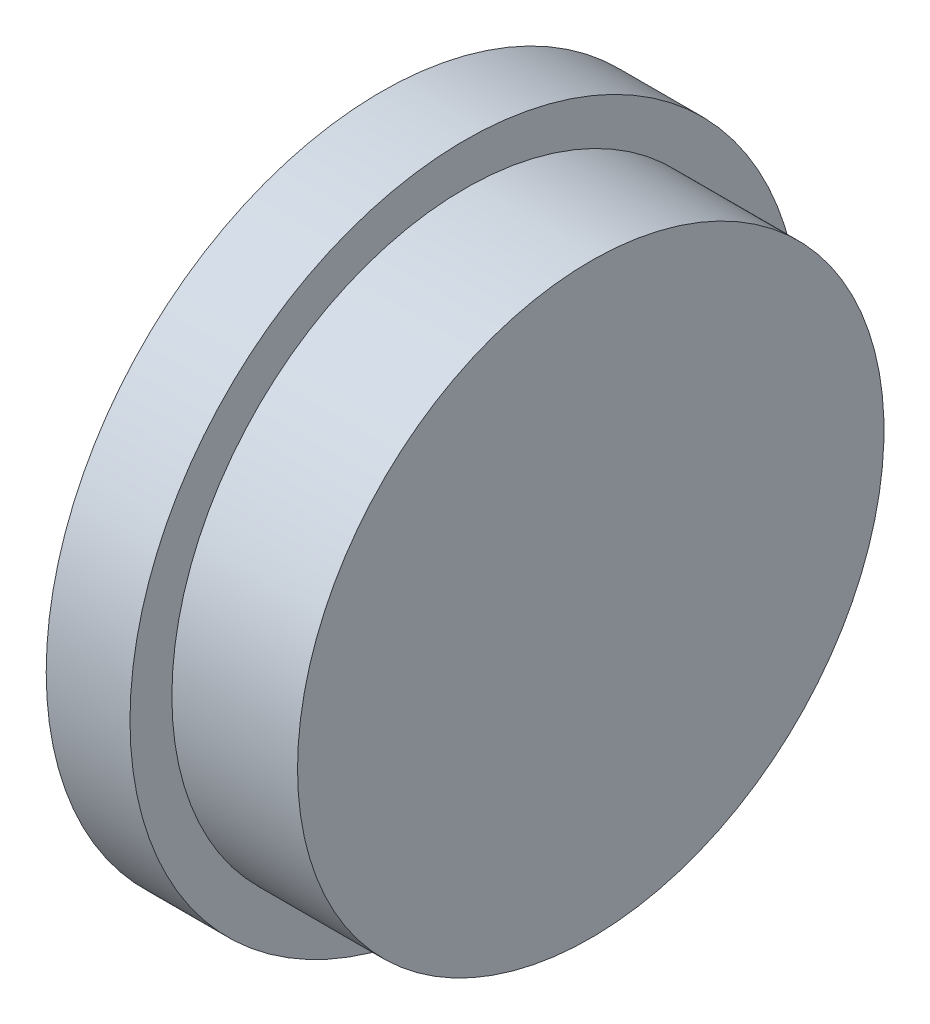
ISO-10303-21;
HEADER;
FILE_DESCRIPTION(('STEP AP214'),'2;1');
FILE_NAME('part.step','',(''),(''),'','','');
FILE_SCHEMA(('AUTOMOTIVE_DESIGN { 1 0 10303 214 1 1 1 1 }'));
ENDSEC;
DATA;
#1=APPLICATION_CONTEXT('core data for automotive mechanical design processes');
#2=APPLICATION_PROTOCOL_DEFINITION('international standard','automotive_design',2000,#1);
#3=PRODUCT_CONTEXT('',#1,'mechanical');
#4=PRODUCT('Part','Part','',(#3));
#5=PRODUCT_RELATED_PRODUCT_CATEGORY('part','',(#4));
#6=PRODUCT_DEFINITION_FORMATION('','',#4);
#7=PRODUCT_DEFINITION_CONTEXT('part definition',#1,'design');
#8=PRODUCT_DEFINITION('design','',#6,#7);
#9=PRODUCT_DEFINITION_SHAPE('','',#8);
#10=(LENGTH_UNIT() NAMED_UNIT(*) SI_UNIT(.MILLI.,.METRE.));
#11=(NAMED_UNIT(*) PLANE_ANGLE_UNIT() SI_UNIT($,.RADIAN.));
#12=(NAMED_UNIT(*) SI_UNIT($,.STERADIAN.) SOLID_ANGLE_UNIT());
#13=UNCERTAINTY_MEASURE_WITH_UNIT(LENGTH_MEASURE(1.E-05),#10,'distance_accuracy_value','');
#14=(GEOMETRIC_REPRESENTATION_CONTEXT(3) GLOBAL_UNCERTAINTY_ASSIGNED_CONTEXT((#13)) GLOBAL_UNIT_ASSIGNED_CONTEXT((#10,
#11,#12)) REPRESENTATION_CONTEXT('',''));
#15=CARTESIAN_POINT('',(0.,0.,0.));
#16=DIRECTION('',(0.,0.,1.));
#17=DIRECTION('',(1.,0.,0.));
#18=AXIS2_PLACEMENT_3D('',#15,#16,#17);
#19=CARTESIAN_POINT('',(13.,0.,0.));
#20=DIRECTION('',(1.,0.,0.));
#21=DIRECTION('',(0.,0.,-1.));
#22=AXIS2_PLACEMENT_3D('',#19,#20,#21);
#23=PLANE('',#22);
#24=CARTESIAN_POINT('',(13.,0.,0.));
#25=DIRECTION('',(-1.,0.,0.));
#26=DIRECTION('',(0.,0.,1.));
#27=AXIS2_PLACEMENT_3D('',#24,#25,#26);
#28=CIRCLE('',#27,16.);
#29=CARTESIAN_POINT('',(13.,0.,16.));
#30=VERTEX_POINT('',#29);
#31=EDGE_CURVE('E10',#30,#30,#28,.T.);
#32=ORIENTED_EDGE('',*,*,#31,.T.);
#33=EDGE_LOOP('',(#32));
#34=FACE_BOUND('',#33,.T.);
#35=ADVANCED_FACE('F34',(#34),#23,.F.);
#36=CARTESIAN_POINT('',(0.,0.,0.));
#37=DIRECTION('',(-1.,0.,0.));
#38=DIRECTION('',(0.,0.,1.));
#39=AXIS2_PLACEMENT_3D('',#36,#37,#38);
#40=CYLINDRICAL_SURFACE('',#39,16.);
#41=ORIENTED_EDGE('',*,*,#31,.F.);
#42=EDGE_LOOP('',(#41));
#43=FACE_BOUND('',#42,.T.);
#44=CARTESIAN_POINT('',(0.,0.,0.));
#45=DIRECTION('',(-1.,0.,0.));
#46=DIRECTION('',(0.,0.,1.));
#47=AXIS2_PLACEMENT_3D('',#44,#45,#46);
#48=CIRCLE('',#47,16.);
#49=CARTESIAN_POINT('',(0.,0.,16.));
#50=VERTEX_POINT('',#49);
#51=EDGE_CURVE('E40',#50,#50,#48,.T.);
#52=ORIENTED_EDGE('',*,*,#51,.T.);
#53=EDGE_LOOP('',(#52));
#54=FACE_BOUND('',#53,.T.);
#55=ADVANCED_FACE('F72',(#43,#54),#40,.F.);
#56=CARTESIAN_POINT('',(0.,16.,0.));
#57=DIRECTION('',(1.,0.,0.));
#58=DIRECTION('',(0.,0.,-1.));
#59=AXIS2_PLACEMENT_3D('',#56,#57,#58);
#60=PLANE('',#59);
#61=ORIENTED_EDGE('',*,*,#51,.F.);
#62=EDGE_LOOP('',(#61));
#63=FACE_BOUND('',#62,.T.);
#64=CARTESIAN_POINT('',(0.,0.,0.));
#65=DIRECTION('',(-1.,0.,0.));
#66=DIRECTION('',(0.,0.,1.));
#67=AXIS2_PLACEMENT_3D('',#64,#65,#66);
#68=CIRCLE('',#67,24.);
#69=CARTESIAN_POINT('',(0.,0.,24.));
#70=VERTEX_POINT('',#69);
#71=EDGE_CURVE('E44',#70,#70,#68,.T.);
#72=ORIENTED_EDGE('',*,*,#71,.T.);
#73=EDGE_LOOP('',(#72));
#74=FACE_BOUND('',#73,.T.);
#75=ADVANCED_FACE('F76',(#63,#74),#60,.F.);
#76=CARTESIAN_POINT('',(0.,0.,0.));
#77=DIRECTION('',(-1.,0.,0.));
#78=DIRECTION('',(0.,0.,1.));
#79=AXIS2_PLACEMENT_3D('',#76,#77,#78);
#80=CYLINDRICAL_SURFACE('',#79,24.);
#81=ORIENTED_EDGE('',*,*,#71,.F.);
#82=EDGE_LOOP('',(#81));
#83=FACE_BOUND('',#82,.T.);
#84=CARTESIAN_POINT('',(6.,0.,0.));
#85=DIRECTION('',(-1.,0.,0.));
#86=DIRECTION('',(0.,0.,1.));
#87=AXIS2_PLACEMENT_3D('',#84,#85,#86);
#88=CIRCLE('',#87,24.);
#89=CARTESIAN_POINT('',(6.,0.,24.));
#90=VERTEX_POINT('',#89);
#91=EDGE_CURVE('E48',#90,#90,#88,.T.);
#92=ORIENTED_EDGE('',*,*,#91,.T.);
#93=EDGE_LOOP('',(#92));
#94=FACE_BOUND('',#93,.T.);
#95=ADVANCED_FACE('F81',(#83,#94),#80,.T.);
#96=CARTESIAN_POINT('',(6.,24.,0.));
#97=DIRECTION('',(-1.,0.,0.));
#98=DIRECTION('',(0.,0.,1.));
#99=AXIS2_PLACEMENT_3D('',#96,#97,#98);
#100=PLANE('',#99);
#101=ORIENTED_EDGE('',*,*,#91,.F.);
#102=EDGE_LOOP('',(#101));
#103=FACE_BOUND('',#102,.T.);
#104=CARTESIAN_POINT('',(6.,0.,0.));
#105=DIRECTION('',(-1.,0.,0.));
#106=DIRECTION('',(0.,0.,1.));
#107=AXIS2_PLACEMENT_3D('',#104,#105,#106);
#108=CIRCLE('',#107,21.);
#109=CARTESIAN_POINT('',(6.,0.,21.));
#110=VERTEX_POINT('',#109);
#111=EDGE_CURVE('E53',#110,#110,#108,.T.);
#112=ORIENTED_EDGE('',*,*,#111,.T.);
#113=EDGE_LOOP('',(#112));
#114=FACE_BOUND('',#113,.T.);
#115=ADVANCED_FACE('F68',(#103,#114),#100,.F.);
#116=CARTESIAN_POINT('',(0.,0.,0.));
#117=DIRECTION('',(-1.,0.,0.));
#118=DIRECTION('',(0.,0.,1.));
#119=AXIS2_PLACEMENT_3D('',#116,#117,#118);
#120=CYLINDRICAL_SURFACE('',#119,21.);
#121=ORIENTED_EDGE('',*,*,#111,.F.);
#122=EDGE_LOOP('',(#121));
#123=FACE_BOUND('',#122,.T.);
#124=CARTESIAN_POINT('',(15.,0.,0.));
#125=DIRECTION('',(-1.,0.,0.));
#126=DIRECTION('',(0.,0.,1.));
#127=AXIS2_PLACEMENT_3D('',#124,#125,#126);
#128=CIRCLE('',#127,21.);
#129=CARTESIAN_POINT('',(15.,0.,21.));
#130=VERTEX_POINT('',#129);
#131=EDGE_CURVE('E56',#130,#130,#128,.T.);
#132=ORIENTED_EDGE('',*,*,#131,.T.);
#133=EDGE_LOOP('',(#132));
#134=FACE_BOUND('',#133,.T.);
#135=ADVANCED_FACE('F60',(#123,#134),#120,.T.);
#136=CARTESIAN_POINT('',(15.,21.,0.));
#137=DIRECTION('',(-1.,0.,0.));
#138=DIRECTION('',(0.,0.,1.));
#139=AXIS2_PLACEMENT_3D('',#136,#137,#138);
#140=PLANE('',#139);
#141=ORIENTED_EDGE('',*,*,#131,.F.);
#142=EDGE_LOOP('',(#141));
#143=FACE_BOUND('',#142,.T.);
#144=ADVANCED_FACE('F62',(#143),#140,.F.);
#145=CLOSED_SHELL('',(#35,#55,#75,#95,#115,#135,#144));
#146=MANIFOLD_SOLID_BREP('B2',#145);
#147=ADVANCED_BREP_SHAPE_REPRESENTATION('',(#18,#146),#14);
#148=SHAPE_DEFINITION_REPRESENTATION(#9,#147);
ENDSEC;
END-ISO-10303-21;
